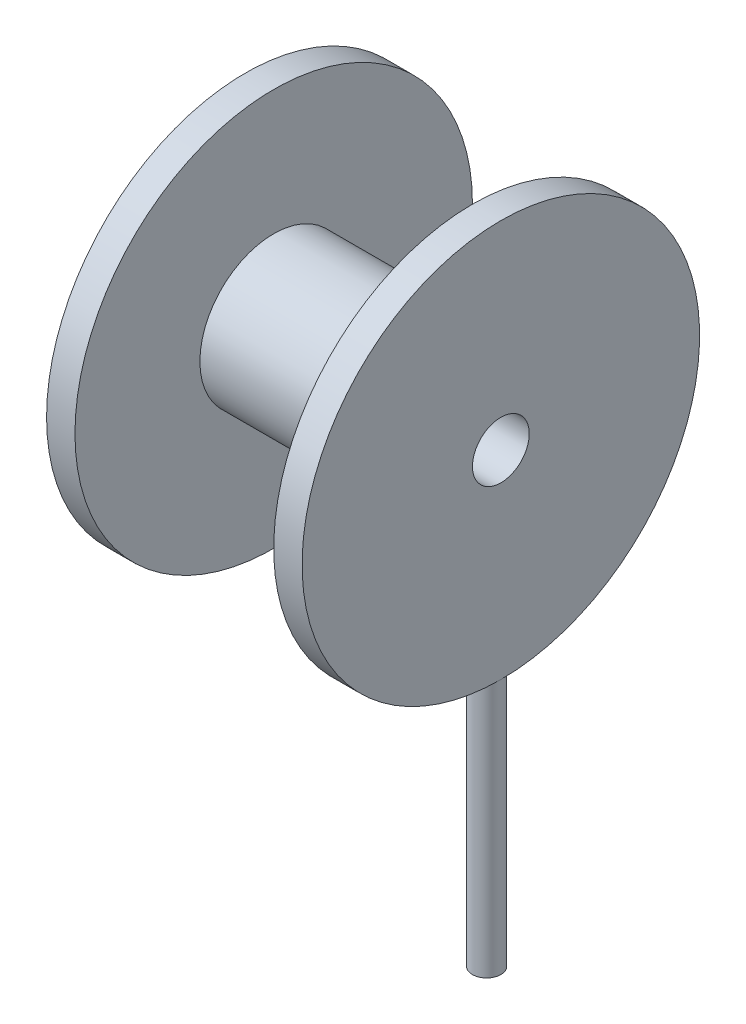
ISO-10303-21;
HEADER;
FILE_DESCRIPTION(('STEP AP214'),'2;1');
FILE_NAME('part.step','',(''),(''),'','','');
FILE_SCHEMA(('AUTOMOTIVE_DESIGN { 1 0 10303 214 1 1 1 1 }'));
ENDSEC;
DATA;
#1=APPLICATION_CONTEXT('core data for automotive mechanical design processes');
#2=APPLICATION_PROTOCOL_DEFINITION('international standard','automotive_design',2000,#1);
#3=PRODUCT_CONTEXT('',#1,'mechanical');
#4=PRODUCT('Part','Part','',(#3));
#5=PRODUCT_RELATED_PRODUCT_CATEGORY('part','',(#4));
#6=PRODUCT_DEFINITION_FORMATION('','',#4);
#7=PRODUCT_DEFINITION_CONTEXT('part definition',#1,'design');
#8=PRODUCT_DEFINITION('design','',#6,#7);
#9=PRODUCT_DEFINITION_SHAPE('','',#8);
#10=(LENGTH_UNIT() NAMED_UNIT(*) SI_UNIT(.MILLI.,.METRE.));
#11=(NAMED_UNIT(*) PLANE_ANGLE_UNIT() SI_UNIT($,.RADIAN.));
#12=(NAMED_UNIT(*) SI_UNIT($,.STERADIAN.) SOLID_ANGLE_UNIT());
#13=UNCERTAINTY_MEASURE_WITH_UNIT(LENGTH_MEASURE(1.E-05),#10,'distance_accuracy_value','');
#14=(GEOMETRIC_REPRESENTATION_CONTEXT(3) GLOBAL_UNCERTAINTY_ASSIGNED_CONTEXT((#13)) GLOBAL_UNIT_ASSIGNED_CONTEXT((#10,
#11,#12)) REPRESENTATION_CONTEXT('',''));
#15=CARTESIAN_POINT('',(0.,0.,0.));
#16=DIRECTION('',(0.,0.,1.));
#17=DIRECTION('',(1.,0.,0.));
#18=AXIS2_PLACEMENT_3D('',#15,#16,#17);
#19=CARTESIAN_POINT('',(-22.6297954405687,0.,0.));
#20=DIRECTION('',(-1.,0.,0.));
#21=DIRECTION('',(0.,0.,1.));
#22=AXIS2_PLACEMENT_3D('',#19,#20,#21);
#23=CYLINDRICAL_SURFACE('',#22,35.);
#24=CARTESIAN_POINT('',(42.5,-34.9106001094224,2.49999999999999));
#25=CARTESIAN_POINT('',(42.3597662156187,-34.9106013009842,2.49999384622088));
#26=CARTESIAN_POINT('',(42.2194353101941,-34.9114541660582,2.48816102267755));
#27=CARTESIAN_POINT('',(41.9426514860751,-34.9147737042987,2.44112914296742));
#28=CARTESIAN_POINT('',(41.8062032230693,-34.9172422362129,2.40590317341536));
#29=CARTESIAN_POINT('',(41.5412338026496,-34.9235120866206,2.31310473405968));
#30=CARTESIAN_POINT('',(41.41270838288,-34.9273126809974,2.2555444035231));
#31=CARTESIAN_POINT('',(41.1671759495099,-34.935817508379,2.11973160545788));
#32=CARTESIAN_POINT('',(41.0501663754006,-34.9405215398181,2.04148375205724));
#33=CARTESIAN_POINT('',(40.8307298164641,-34.9503133990893,1.8663534358288));
#34=CARTESIAN_POINT('',(40.7283279553476,-34.9554018656616,1.76943952624668));
#35=CARTESIAN_POINT('',(40.5412290369921,-34.9653833491045,1.55979386399035));
#36=CARTESIAN_POINT('',(40.4565327318677,-34.9702763576651,1.44706143970106));
#37=CARTESIAN_POINT('',(40.3071689419052,-34.979321378548,1.20883323290623));
#38=CARTESIAN_POINT('',(40.2425226850573,-34.9834726035498,1.08332410847657));
#39=CARTESIAN_POINT('',(40.1352299020203,-34.990559516592,0.823198604146586));
#40=CARTESIAN_POINT('',(40.0925830815639,-34.9934952208912,0.68858234609164));
#41=CARTESIAN_POINT('',(40.0305706780925,-34.9978158775822,0.414309673484058));
#42=CARTESIAN_POINT('',(40.011165131862,-34.9992034916227,0.27466233710994));
#43=CARTESIAN_POINT('',(39.9960626642955,-35.0002806084736,-0.00591390353005207));
#44=CARTESIAN_POINT('',(40.0003654072806,-34.9999701353268,-0.146842789622625));
#45=CARTESIAN_POINT('',(40.0325245316445,-34.9976882707688,-0.425710880401198));
#46=CARTESIAN_POINT('',(40.0603379319208,-34.9957199102546,-0.563655069919063));
#47=CARTESIAN_POINT('',(40.1386620983315,-34.9903472796657,-0.832911896068634));
#48=CARTESIAN_POINT('',(40.1891730312329,-34.9869429990408,-0.964224483967669));
#49=CARTESIAN_POINT('',(40.311506812272,-34.9790764811396,-1.21662813510537));
#50=CARTESIAN_POINT('',(40.3833490485237,-34.9746132821527,-1.33770977022084));
#51=CARTESIAN_POINT('',(40.5462920089203,-34.9651309405075,-1.56611151883489));
#52=CARTESIAN_POINT('',(40.637393018317,-34.9601117896154,-1.67343142846342));
#53=CARTESIAN_POINT('',(40.8365100523092,-34.9500688682285,-1.87151434561125));
#54=CARTESIAN_POINT('',(40.9445633992202,-34.9450451124509,-1.96223984092648));
#55=CARTESIAN_POINT('',(41.1743873871242,-34.9355705444722,-2.1242691127521));
#56=CARTESIAN_POINT('',(41.2961580355612,-34.931119732582,-2.19557287872281));
#57=CARTESIAN_POINT('',(41.5499848339816,-34.9232938755889,-2.31673245908851));
#58=CARTESIAN_POINT('',(41.6820418098301,-34.9199189169748,-2.36658654923887));
#59=CARTESIAN_POINT('',(41.9526810796093,-34.9146282757894,-2.44340496961031));
#60=CARTESIAN_POINT('',(42.0912632730609,-34.9127125707554,-2.47036965217412));
#61=CARTESIAN_POINT('',(42.3706915204954,-34.9105607163687,-2.50059679826772));
#62=CARTESIAN_POINT('',(42.5115318994209,-34.9103208674152,-2.50391147163281));
#63=CARTESIAN_POINT('',(42.7917665062617,-34.911538102081,-2.48688105832807));
#64=CARTESIAN_POINT('',(42.9311607440364,-34.9129951741237,-2.46653613306751));
#65=CARTESIAN_POINT('',(43.204397657478,-34.9174386845258,-2.40280747129513));
#66=CARTESIAN_POINT('',(43.3382459990392,-34.9204235182308,-2.35944790599135));
#67=CARTESIAN_POINT('',(43.596766789602,-34.9275848607993,-2.25094529934471));
#68=CARTESIAN_POINT('',(43.7214391300005,-34.9317613837642,-2.18580200022983));
#69=CARTESIAN_POINT('',(43.9583083976337,-34.9408444549612,-2.03544819945194));
#70=CARTESIAN_POINT('',(44.0704831176474,-34.9457522675833,-1.9502027897671));
#71=CARTESIAN_POINT('',(44.2789489193247,-34.9557405275265,-1.76211522324266));
#72=CARTESIAN_POINT('',(44.3752397992488,-34.9608209770392,-1.65927284293909));
#73=CARTESIAN_POINT('',(44.5493816645446,-34.9705929477922,-1.43868558630043));
#74=CARTESIAN_POINT('',(44.627198810692,-34.9752837452292,-1.32091395926635));
#75=CARTESIAN_POINT('',(44.7619524672741,-34.9837374668193,-1.07394533913417));
#76=CARTESIAN_POINT('',(44.8188891382683,-34.9875003981072,-0.944748433899812));
#77=CARTESIAN_POINT('',(44.9102070507681,-34.9936710038533,-0.678719845089261));
#78=CARTESIAN_POINT('',(44.9446095148873,-34.9960799531813,-0.541895477216698));
#79=CARTESIAN_POINT('',(44.9899518719335,-34.9992762933682,-0.264394743307925));
#80=CARTESIAN_POINT('',(45.0008920795465,-35.0000637059758,-0.123718428961327));
#81=CARTESIAN_POINT('',(44.998996104639,-34.9999283072413,0.157158551507429));
#82=CARTESIAN_POINT('',(44.9862127903131,-34.9990092986799,0.297359579385084));
#83=CARTESIAN_POINT('',(44.9373425112757,-34.9955718973575,0.573618716668828));
#84=CARTESIAN_POINT('',(44.9012555087794,-34.9930535020031,0.709676819357159));
#85=CARTESIAN_POINT('',(44.8068148149971,-34.9867001855664,0.973793948539712));
#86=CARTESIAN_POINT('',(44.7484616573804,-34.9828652960376,1.10185316666349));
#87=CARTESIAN_POINT('',(44.6111517451335,-34.9743089538449,1.34636475268571));
#88=CARTESIAN_POINT('',(44.5321954423041,-34.9695875206224,1.46281737502471));
#89=CARTESIAN_POINT('',(44.3557232429036,-34.95977620993,1.68107963152584));
#90=CARTESIAN_POINT('',(44.2581686306972,-34.9546855778527,1.78285792822937));
#91=CARTESIAN_POINT('',(44.0473306280831,-34.9447158885714,1.96863172921551));
#92=CARTESIAN_POINT('',(43.9340434105599,-34.9398368832279,2.05262289400752));
#93=CARTESIAN_POINT('',(43.694791422926,-34.9308348795401,2.20052035377928));
#94=CARTESIAN_POINT('',(43.5688080617479,-34.9267130155451,2.2643966132442));
#95=CARTESIAN_POINT('',(43.3079645293213,-34.9197061867511,2.37001000657715));
#96=CARTESIAN_POINT('',(43.1731148861045,-34.9168197844766,2.41177288314434));
#97=CARTESIAN_POINT('',(42.9478762944039,-34.9133616093181,2.4612049672651));
#98=CARTESIAN_POINT('',(42.8589405520136,-34.9123307263929,2.47573408624045));
#99=CARTESIAN_POINT('',(42.6800165478292,-34.9109495946005,2.49513356886051));
#100=CARTESIAN_POINT('',(42.5900282880124,-34.910599344455,2.50000395064712));
#101=CARTESIAN_POINT('',(42.5,-34.9106001094224,2.49999999999999));
#102=B_SPLINE_CURVE_WITH_KNOTS('',3,(#24,#25,#26,#27,#28,#29,#30,#31,#32,#33,#34,#35,#36,#37,
#38,#39,#40,#41,#42,#43,#44,#45,#46,#47,#48,#49,#50,#51,#52,#53,#54,#55,#56,#57,#58,#59,#60,#61,
#62,#63,#64,#65,#66,#67,#68,#69,#70,#71,#72,#73,#74,#75,#76,#77,#78,#79,#80,#81,#82,#83,#84,#85,
#86,#87,#88,#89,#90,#91,#92,#93,#94,#95,#96,#97,#98,#99,#100,#101),.UNSPECIFIED.,.T.,.F.,(4,2,2,
2,2,2,2,2,2,2,2,2,2,2,2,2,2,2,2,2,2,2,2,2,2,2,2,2,2,2,2,2,2,2,2,2,2,2,4),(0.,0.420372674340742,
0.841229819528205,1.26185853834787,1.68239351951576,2.10364327403618,2.52491091919571,
2.94662307084332,3.3683295814714,3.78930992470611,4.21028430741624,4.63049074442441,
5.05070026889242,5.47129289888782,5.89189175894007,6.31342995236851,6.73496837455419,
7.15654067602209,7.57810648799805,7.99874136118444,8.41937336475453,8.83956446964644,
9.25976054693389,9.68069175383476,10.101628306539,10.5233300601264,10.9450285709861,
11.3663293548796,11.7876244880682,12.2079818864761,12.6283399664575,13.0486879720403,
13.4690267606991,13.8902503059564,14.3115764981829,14.7335288625457,15.1549889364476,
15.4248632998188,15.6947371562869),.UNSPECIFIED.);
#103=CARTESIAN_POINT('',(40.,-35.,0.));
#104=VERTEX_POINT('',#103);
#105=CARTESIAN_POINT('',(45.,-35.,0.));
#106=VERTEX_POINT('',#105);
#107=EDGE_CURVE('E51',#104,#106,#102,.T.);
#108=ORIENTED_EDGE('',*,*,#107,.F.);
#109=CARTESIAN_POINT('',(40.,0.,0.));
#110=DIRECTION('',(-1.,0.,0.));
#111=DIRECTION('',(0.,0.,1.));
#112=AXIS2_PLACEMENT_3D('',#109,#110,#111);
#113=CIRCLE('',#112,35.);
#114=EDGE_CURVE('E49',#104,#104,#113,.T.);
#115=ORIENTED_EDGE('',*,*,#114,.F.);
#116=EDGE_CURVE('E46',#106,#104,#102,.T.);
#117=ORIENTED_EDGE('',*,*,#116,.F.);
#118=CARTESIAN_POINT('',(45.,0.,0.));
#119=DIRECTION('',(-1.,0.,0.));
#120=DIRECTION('',(0.,0.,1.));
#121=AXIS2_PLACEMENT_3D('',#118,#119,#120);
#122=CIRCLE('',#121,35.);
#123=EDGE_CURVE('E54',#106,#106,#122,.T.);
#124=ORIENTED_EDGE('',*,*,#123,.T.);
#125=EDGE_LOOP('',(#108,#115,#117,#124));
#126=FACE_BOUND('',#125,.T.);
#127=ADVANCED_FACE('F31',(#126),#23,.T.);
#128=CARTESIAN_POINT('',(-22.6297954405687,0.,0.));
#129=DIRECTION('',(-1.,0.,0.));
#130=DIRECTION('',(0.,0.,1.));
#131=AXIS2_PLACEMENT_3D('',#128,#129,#130);
#132=CYLINDRICAL_SURFACE('',#131,5.);
#133=CARTESIAN_POINT('',(45.,0.,0.));
#134=DIRECTION('',(-1.,0.,0.));
#135=DIRECTION('',(0.,0.,1.));
#136=AXIS2_PLACEMENT_3D('',#133,#134,#135);
#137=CIRCLE('',#136,5.00000000000001);
#138=CARTESIAN_POINT('',(45.,0.,5.00000000000001));
#139=VERTEX_POINT('',#138);
#140=EDGE_CURVE('E59',#139,#139,#137,.T.);
#141=ORIENTED_EDGE('',*,*,#140,.F.);
#142=EDGE_LOOP('',(#141));
#143=FACE_BOUND('',#142,.T.);
#144=CARTESIAN_POINT('',(0.,0.,0.));
#145=DIRECTION('',(-1.,0.,0.));
#146=DIRECTION('',(0.,0.,1.));
#147=AXIS2_PLACEMENT_3D('',#144,#145,#146);
#148=CIRCLE('',#147,4.99999999999999);
#149=CARTESIAN_POINT('',(0.,0.,4.99999999999999));
#150=VERTEX_POINT('',#149);
#151=EDGE_CURVE('E11',#150,#150,#148,.T.);
#152=ORIENTED_EDGE('',*,*,#151,.T.);
#153=EDGE_LOOP('',(#152));
#154=FACE_BOUND('',#153,.T.);
#155=ADVANCED_FACE('F33',(#143,#154),#132,.F.);
#156=CARTESIAN_POINT('',(0.,4.99999999999999,0.));
#157=DIRECTION('',(1.,0.,0.));
#158=DIRECTION('',(0.,0.,-1.));
#159=AXIS2_PLACEMENT_3D('',#156,#157,#158);
#160=PLANE('',#159);
#161=ORIENTED_EDGE('',*,*,#151,.F.);
#162=EDGE_LOOP('',(#161));
#163=FACE_BOUND('',#162,.T.);
#164=CARTESIAN_POINT('',(0.,0.,0.));
#165=DIRECTION('',(-1.,0.,0.));
#166=DIRECTION('',(0.,0.,1.));
#167=AXIS2_PLACEMENT_3D('',#164,#165,#166);
#168=CIRCLE('',#167,35.);
#169=CARTESIAN_POINT('',(0.,0.,35.));
#170=VERTEX_POINT('',#169);
#171=EDGE_CURVE('E39',#170,#170,#168,.T.);
#172=ORIENTED_EDGE('',*,*,#171,.T.);
#173=EDGE_LOOP('',(#172));
#174=FACE_BOUND('',#173,.T.);
#175=ADVANCED_FACE('F70',(#163,#174),#160,.F.);
#176=CARTESIAN_POINT('',(-22.6297954405687,0.,0.));
#177=DIRECTION('',(-1.,0.,0.));
#178=DIRECTION('',(0.,0.,1.));
#179=AXIS2_PLACEMENT_3D('',#176,#177,#178);
#180=CYLINDRICAL_SURFACE('',#179,35.);
#181=ORIENTED_EDGE('',*,*,#171,.F.);
#182=EDGE_LOOP('',(#181));
#183=FACE_BOUND('',#182,.T.);
#184=CARTESIAN_POINT('',(5.,0.,0.));
#185=DIRECTION('',(-1.,0.,0.));
#186=DIRECTION('',(0.,0.,1.));
#187=AXIS2_PLACEMENT_3D('',#184,#185,#186);
#188=CIRCLE('',#187,35.);
#189=CARTESIAN_POINT('',(5.,0.,35.));
#190=VERTEX_POINT('',#189);
#191=EDGE_CURVE('E65',#190,#190,#188,.T.);
#192=ORIENTED_EDGE('',*,*,#191,.T.);
#193=EDGE_LOOP('',(#192));
#194=FACE_BOUND('',#193,.T.);
#195=ADVANCED_FACE('F72',(#183,#194),#180,.T.);
#196=CARTESIAN_POINT('',(5.,35.,0.));
#197=DIRECTION('',(-1.,0.,0.));
#198=DIRECTION('',(0.,0.,1.));
#199=AXIS2_PLACEMENT_3D('',#196,#197,#198);
#200=PLANE('',#199);
#201=ORIENTED_EDGE('',*,*,#191,.F.);
#202=EDGE_LOOP('',(#201));
#203=FACE_BOUND('',#202,.T.);
#204=CARTESIAN_POINT('',(5.,0.,0.));
#205=DIRECTION('',(-1.,0.,0.));
#206=DIRECTION('',(0.,0.,1.));
#207=AXIS2_PLACEMENT_3D('',#204,#205,#206);
#208=CIRCLE('',#207,13.);
#209=CARTESIAN_POINT('',(5.,0.,13.));
#210=VERTEX_POINT('',#209);
#211=EDGE_CURVE('E57',#210,#210,#208,.T.);
#212=ORIENTED_EDGE('',*,*,#211,.T.);
#213=EDGE_LOOP('',(#212));
#214=FACE_BOUND('',#213,.T.);
#215=ADVANCED_FACE('F75',(#203,#214),#200,.F.);
#216=CARTESIAN_POINT('',(-22.6297954405687,0.,0.));
#217=DIRECTION('',(-1.,0.,0.));
#218=DIRECTION('',(0.,0.,1.));
#219=AXIS2_PLACEMENT_3D('',#216,#217,#218);
#220=CYLINDRICAL_SURFACE('',#219,13.);
#221=ORIENTED_EDGE('',*,*,#211,.F.);
#222=EDGE_LOOP('',(#221));
#223=FACE_BOUND('',#222,.T.);
#224=CARTESIAN_POINT('',(40.,0.,0.));
#225=DIRECTION('',(-1.,0.,0.));
#226=DIRECTION('',(0.,0.,1.));
#227=AXIS2_PLACEMENT_3D('',#224,#225,#226);
#228=CIRCLE('',#227,13.);
#229=CARTESIAN_POINT('',(40.,0.,13.));
#230=VERTEX_POINT('',#229);
#231=EDGE_CURVE('E53',#230,#230,#228,.T.);
#232=ORIENTED_EDGE('',*,*,#231,.T.);
#233=EDGE_LOOP('',(#232));
#234=FACE_BOUND('',#233,.T.);
#235=ADVANCED_FACE('F81',(#223,#234),#220,.T.);
#236=CARTESIAN_POINT('',(40.,13.,0.));
#237=DIRECTION('',(1.,0.,0.));
#238=DIRECTION('',(0.,0.,-1.));
#239=AXIS2_PLACEMENT_3D('',#236,#237,#238);
#240=PLANE('',#239);
#241=ORIENTED_EDGE('',*,*,#114,.T.);
#242=EDGE_LOOP('',(#241));
#243=FACE_BOUND('',#242,.T.);
#244=ORIENTED_EDGE('',*,*,#231,.F.);
#245=EDGE_LOOP('',(#244));
#246=FACE_BOUND('',#245,.T.);
#247=ADVANCED_FACE('F87',(#243,#246),#240,.F.);
#248=CARTESIAN_POINT('',(45.,35.,0.));
#249=DIRECTION('',(-1.,0.,0.));
#250=DIRECTION('',(0.,0.,1.));
#251=AXIS2_PLACEMENT_3D('',#248,#249,#250);
#252=PLANE('',#251);
#253=ORIENTED_EDGE('',*,*,#123,.F.);
#254=EDGE_LOOP('',(#253));
#255=FACE_BOUND('',#254,.T.);
#256=ORIENTED_EDGE('',*,*,#140,.T.);
#257=EDGE_LOOP('',(#256));
#258=FACE_BOUND('',#257,.T.);
#259=ADVANCED_FACE('F92',(#255,#258),#252,.F.);
#260=CARTESIAN_POINT('',(42.5,-30.,0.));
#261=DIRECTION('',(0.,1.,0.));
#262=DIRECTION('',(0.,0.,1.));
#263=AXIS2_PLACEMENT_3D('',#260,#261,#262);
#264=CYLINDRICAL_SURFACE('',#263,2.5);
#265=CARTESIAN_POINT('',(42.5,-80.,0.));
#266=DIRECTION('',(0.,1.,0.));
#267=DIRECTION('',(0.,0.,1.));
#268=AXIS2_PLACEMENT_3D('',#265,#266,#267);
#269=CIRCLE('',#268,2.5);
#270=CARTESIAN_POINT('',(42.5,-80.,2.49999999999998));
#271=VERTEX_POINT('',#270);
#272=EDGE_CURVE('E113',#271,#271,#269,.T.);
#273=ORIENTED_EDGE('',*,*,#272,.T.);
#274=EDGE_LOOP('',(#273));
#275=FACE_BOUND('',#274,.T.);
#276=ORIENTED_EDGE('',*,*,#116,.T.);
#277=ORIENTED_EDGE('',*,*,#107,.T.);
#278=EDGE_LOOP('',(#276,#277));
#279=FACE_BOUND('',#278,.T.);
#280=ADVANCED_FACE('F97',(#275,#279),#264,.T.);
#281=CARTESIAN_POINT('',(42.5,-80.,0.));
#282=DIRECTION('',(0.,1.,0.));
#283=DIRECTION('',(0.,0.,1.));
#284=AXIS2_PLACEMENT_3D('',#281,#282,#283);
#285=PLANE('',#284);
#286=ORIENTED_EDGE('',*,*,#272,.F.);
#287=EDGE_LOOP('',(#286));
#288=FACE_BOUND('',#287,.T.);
#289=ADVANCED_FACE('F116',(#288),#285,.F.);
#290=CLOSED_SHELL('',(#127,#155,#175,#195,#215,#235,#247,#259,#280,#289));
#291=MANIFOLD_SOLID_BREP('B2',#290);
#292=ADVANCED_BREP_SHAPE_REPRESENTATION('',(#18,#291),#14);
#293=SHAPE_DEFINITION_REPRESENTATION(#9,#292);
ENDSEC;
END-ISO-10303-21;
